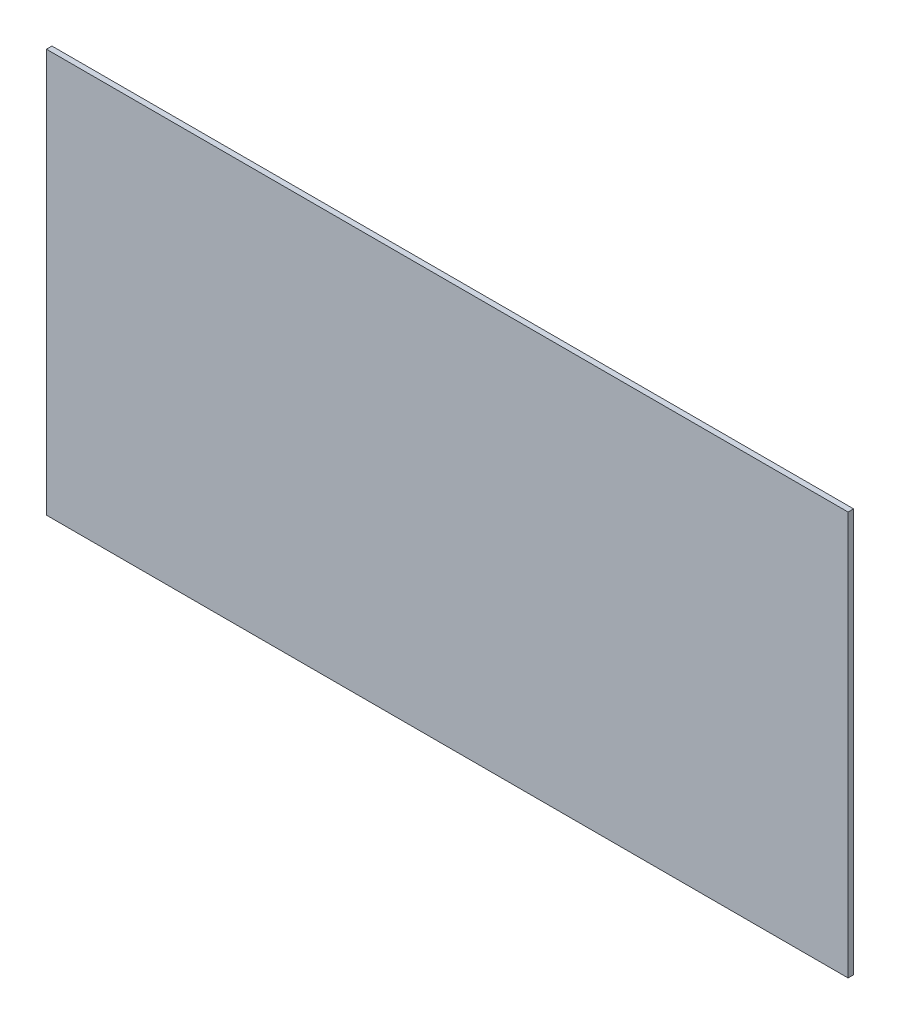
ISO-10303-21;
HEADER;
FILE_DESCRIPTION(('STEP AP214'),'2;1');
FILE_NAME('part.step','',(''),(''),'','','');
FILE_SCHEMA(('AUTOMOTIVE_DESIGN { 1 0 10303 214 1 1 1 1 }'));
ENDSEC;
DATA;
#1=APPLICATION_CONTEXT('core data for automotive mechanical design processes');
#2=APPLICATION_PROTOCOL_DEFINITION('international standard','automotive_design',2000,#1);
#3=PRODUCT_CONTEXT('',#1,'mechanical');
#4=PRODUCT('Part','Part','',(#3));
#5=PRODUCT_RELATED_PRODUCT_CATEGORY('part','',(#4));
#6=PRODUCT_DEFINITION_FORMATION('','',#4);
#7=PRODUCT_DEFINITION_CONTEXT('part definition',#1,'design');
#8=PRODUCT_DEFINITION('design','',#6,#7);
#9=PRODUCT_DEFINITION_SHAPE('','',#8);
#10=(LENGTH_UNIT() NAMED_UNIT(*) SI_UNIT(.MILLI.,.METRE.));
#11=(NAMED_UNIT(*) PLANE_ANGLE_UNIT() SI_UNIT($,.RADIAN.));
#12=(NAMED_UNIT(*) SI_UNIT($,.STERADIAN.) SOLID_ANGLE_UNIT());
#13=UNCERTAINTY_MEASURE_WITH_UNIT(LENGTH_MEASURE(1.E-05),#10,'distance_accuracy_value','');
#14=(GEOMETRIC_REPRESENTATION_CONTEXT(3) GLOBAL_UNCERTAINTY_ASSIGNED_CONTEXT((#13)) GLOBAL_UNIT_ASSIGNED_CONTEXT((#10,
#11,#12)) REPRESENTATION_CONTEXT('',''));
#15=CARTESIAN_POINT('',(0.,0.,0.));
#16=DIRECTION('',(0.,0.,1.));
#17=DIRECTION('',(1.,0.,0.));
#18=AXIS2_PLACEMENT_3D('',#15,#16,#17);
#19=CARTESIAN_POINT('',(0.,0.,2.));
#20=DIRECTION('',(-1.,0.,0.));
#21=DIRECTION('',(0.,0.,1.));
#22=AXIS2_PLACEMENT_3D('',#19,#20,#21);
#23=PLANE('',#22);
#24=DIRECTION('',(0.,1.,0.));
#25=VECTOR('',#24,1.);
#26=CARTESIAN_POINT('',(0.,0.,0.));
#27=LINE('',#26,#25);
#28=CARTESIAN_POINT('',(0.,0.,0.));
#29=VERTEX_POINT('',#28);
#30=CARTESIAN_POINT('',(0.,146.59,0.));
#31=VERTEX_POINT('',#30);
#32=EDGE_CURVE('E113',#29,#31,#27,.T.);
#33=ORIENTED_EDGE('',*,*,#32,.T.);
#34=DIRECTION('',(0.,0.,-1.));
#35=VECTOR('',#34,1.);
#36=CARTESIAN_POINT('',(0.,146.59,2.));
#37=LINE('',#36,#35);
#38=CARTESIAN_POINT('',(0.,146.59,2.));
#39=VERTEX_POINT('',#38);
#40=EDGE_CURVE('E11',#39,#31,#37,.T.);
#41=ORIENTED_EDGE('',*,*,#40,.F.);
#42=DIRECTION('',(0.,1.,0.));
#43=VECTOR('',#42,1.);
#44=CARTESIAN_POINT('',(0.,0.,2.));
#45=LINE('',#44,#43);
#46=CARTESIAN_POINT('',(0.,0.,2.));
#47=VERTEX_POINT('',#46);
#48=EDGE_CURVE('E97',#47,#39,#45,.T.);
#49=ORIENTED_EDGE('',*,*,#48,.F.);
#50=DIRECTION('',(0.,0.,-1.));
#51=VECTOR('',#50,1.);
#52=CARTESIAN_POINT('',(0.,0.,2.));
#53=LINE('',#52,#51);
#54=EDGE_CURVE('E109',#47,#29,#53,.T.);
#55=ORIENTED_EDGE('',*,*,#54,.T.);
#56=EDGE_LOOP('',(#33,#41,#49,#55));
#57=FACE_BOUND('',#56,.T.);
#58=ADVANCED_FACE('F45',(#57),#23,.F.);
#59=CARTESIAN_POINT('',(0.,146.59,2.));
#60=DIRECTION('',(0.,-1.,0.));
#61=DIRECTION('',(1.,0.,0.));
#62=AXIS2_PLACEMENT_3D('',#59,#60,#61);
#63=PLANE('',#62);
#64=DIRECTION('',(-1.,0.,0.));
#65=VECTOR('',#64,1.);
#66=CARTESIAN_POINT('',(0.,146.59,0.));
#67=LINE('',#66,#65);
#68=CARTESIAN_POINT('',(-291.2,146.59,0.));
#69=VERTEX_POINT('',#68);
#70=EDGE_CURVE('E102',#31,#69,#67,.T.);
#71=ORIENTED_EDGE('',*,*,#70,.T.);
#72=DIRECTION('',(0.,0.,-1.));
#73=VECTOR('',#72,1.);
#74=CARTESIAN_POINT('',(-291.2,146.59,2.));
#75=LINE('',#74,#73);
#76=CARTESIAN_POINT('',(-291.2,146.59,2.));
#77=VERTEX_POINT('',#76);
#78=EDGE_CURVE('E54',#77,#69,#75,.T.);
#79=ORIENTED_EDGE('',*,*,#78,.F.);
#80=DIRECTION('',(-1.,0.,0.));
#81=VECTOR('',#80,1.);
#82=CARTESIAN_POINT('',(0.,146.59,2.));
#83=LINE('',#82,#81);
#84=EDGE_CURVE('E92',#39,#77,#83,.T.);
#85=ORIENTED_EDGE('',*,*,#84,.F.);
#86=ORIENTED_EDGE('',*,*,#40,.T.);
#87=EDGE_LOOP('',(#71,#79,#85,#86));
#88=FACE_BOUND('',#87,.T.);
#89=ADVANCED_FACE('F101',(#88),#63,.F.);
#90=CARTESIAN_POINT('',(-291.2,0.,2.));
#91=DIRECTION('',(1.,0.,0.));
#92=DIRECTION('',(0.,0.,-1.));
#93=AXIS2_PLACEMENT_3D('',#90,#91,#92);
#94=PLANE('',#93);
#95=DIRECTION('',(0.,-1.,0.));
#96=VECTOR('',#95,1.);
#97=CARTESIAN_POINT('',(-291.2,0.,0.));
#98=LINE('',#97,#96);
#99=CARTESIAN_POINT('',(-291.2,0.,0.));
#100=VERTEX_POINT('',#99);
#101=EDGE_CURVE('E79',#69,#100,#98,.T.);
#102=ORIENTED_EDGE('',*,*,#101,.T.);
#103=DIRECTION('',(0.,0.,-1.));
#104=VECTOR('',#103,1.);
#105=CARTESIAN_POINT('',(-291.2,0.,2.));
#106=LINE('',#105,#104);
#107=CARTESIAN_POINT('',(-291.2,0.,2.));
#108=VERTEX_POINT('',#107);
#109=EDGE_CURVE('E104',#108,#100,#106,.T.);
#110=ORIENTED_EDGE('',*,*,#109,.F.);
#111=DIRECTION('',(0.,-1.,0.));
#112=VECTOR('',#111,1.);
#113=CARTESIAN_POINT('',(-291.2,0.,2.));
#114=LINE('',#113,#112);
#115=EDGE_CURVE('E95',#77,#108,#114,.T.);
#116=ORIENTED_EDGE('',*,*,#115,.F.);
#117=ORIENTED_EDGE('',*,*,#78,.T.);
#118=EDGE_LOOP('',(#102,#110,#116,#117));
#119=FACE_BOUND('',#118,.T.);
#120=ADVANCED_FACE('F105',(#119),#94,.F.);
#121=CARTESIAN_POINT('',(0.,0.,2.));
#122=DIRECTION('',(0.,1.,0.));
#123=DIRECTION('',(-1.,0.,0.));
#124=AXIS2_PLACEMENT_3D('',#121,#122,#123);
#125=PLANE('',#124);
#126=DIRECTION('',(1.,0.,0.));
#127=VECTOR('',#126,1.);
#128=CARTESIAN_POINT('',(0.,0.,0.));
#129=LINE('',#128,#127);
#130=EDGE_CURVE('E85',#100,#29,#129,.T.);
#131=ORIENTED_EDGE('',*,*,#130,.T.);
#132=ORIENTED_EDGE('',*,*,#54,.F.);
#133=DIRECTION('',(1.,0.,0.));
#134=VECTOR('',#133,1.);
#135=CARTESIAN_POINT('',(0.,0.,2.));
#136=LINE('',#135,#134);
#137=EDGE_CURVE('E62',#108,#47,#136,.T.);
#138=ORIENTED_EDGE('',*,*,#137,.F.);
#139=ORIENTED_EDGE('',*,*,#109,.T.);
#140=EDGE_LOOP('',(#131,#132,#138,#139));
#141=FACE_BOUND('',#140,.T.);
#142=ADVANCED_FACE('F126',(#141),#125,.F.);
#143=CARTESIAN_POINT('',(0.,0.,2.));
#144=DIRECTION('',(0.,0.,1.));
#145=DIRECTION('',(1.,0.,0.));
#146=AXIS2_PLACEMENT_3D('',#143,#144,#145);
#147=PLANE('',#146);
#148=ORIENTED_EDGE('',*,*,#48,.T.);
#149=ORIENTED_EDGE('',*,*,#84,.T.);
#150=ORIENTED_EDGE('',*,*,#115,.T.);
#151=ORIENTED_EDGE('',*,*,#137,.T.);
#152=EDGE_LOOP('',(#148,#149,#150,#151));
#153=FACE_BOUND('',#152,.T.);
#154=ADVANCED_FACE('F93',(#153),#147,.T.);
#155=CARTESIAN_POINT('',(0.,0.,0.));
#156=DIRECTION('',(0.,0.,1.));
#157=DIRECTION('',(1.,0.,0.));
#158=AXIS2_PLACEMENT_3D('',#155,#156,#157);
#159=PLANE('',#158);
#160=ORIENTED_EDGE('',*,*,#32,.F.);
#161=ORIENTED_EDGE('',*,*,#130,.F.);
#162=ORIENTED_EDGE('',*,*,#101,.F.);
#163=ORIENTED_EDGE('',*,*,#70,.F.);
#164=EDGE_LOOP('',(#160,#161,#162,#163));
#165=FACE_BOUND('',#164,.T.);
#166=ADVANCED_FACE('F129',(#165),#159,.F.);
#167=CLOSED_SHELL('',(#58,#89,#120,#142,#154,#166));
#168=MANIFOLD_SOLID_BREP('B2',#167);
#169=ADVANCED_BREP_SHAPE_REPRESENTATION('',(#18,#168),#14);
#170=SHAPE_DEFINITION_REPRESENTATION(#9,#169);
ENDSEC;
END-ISO-10303-21;
